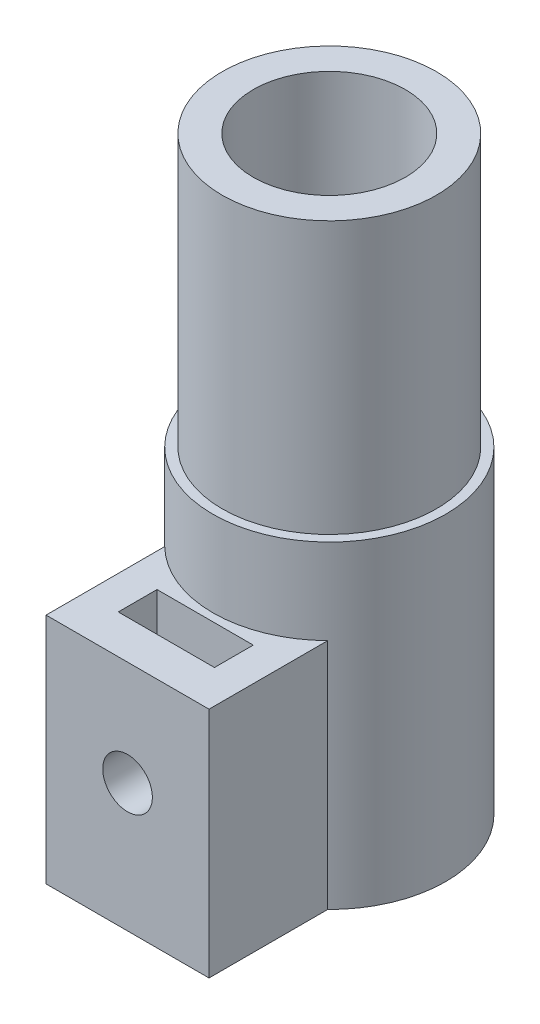
ISO-10303-21;
HEADER;
FILE_DESCRIPTION(('STEP AP214'),'2;1');
FILE_NAME('part.step','',(''),(''),'','','');
FILE_SCHEMA(('AUTOMOTIVE_DESIGN { 1 0 10303 214 1 1 1 1 }'));
ENDSEC;
DATA;
#1=APPLICATION_CONTEXT('core data for automotive mechanical design processes');
#2=APPLICATION_PROTOCOL_DEFINITION('international standard','automotive_design',2000,#1);
#3=PRODUCT_CONTEXT('',#1,'mechanical');
#4=PRODUCT('Part','Part','',(#3));
#5=PRODUCT_RELATED_PRODUCT_CATEGORY('part','',(#4));
#6=PRODUCT_DEFINITION_FORMATION('','',#4);
#7=PRODUCT_DEFINITION_CONTEXT('part definition',#1,'design');
#8=PRODUCT_DEFINITION('design','',#6,#7);
#9=PRODUCT_DEFINITION_SHAPE('','',#8);
#10=(LENGTH_UNIT() NAMED_UNIT(*) SI_UNIT(.MILLI.,.METRE.));
#11=(NAMED_UNIT(*) PLANE_ANGLE_UNIT() SI_UNIT($,.RADIAN.));
#12=(NAMED_UNIT(*) SI_UNIT($,.STERADIAN.) SOLID_ANGLE_UNIT());
#13=UNCERTAINTY_MEASURE_WITH_UNIT(LENGTH_MEASURE(1.E-05),#10,'distance_accuracy_value','');
#14=(GEOMETRIC_REPRESENTATION_CONTEXT(3) GLOBAL_UNCERTAINTY_ASSIGNED_CONTEXT((#13)) GLOBAL_UNIT_ASSIGNED_CONTEXT((#10,
#11,#12)) REPRESENTATION_CONTEXT('',''));
#15=CARTESIAN_POINT('',(0.,0.,0.));
#16=DIRECTION('',(0.,0.,1.));
#17=DIRECTION('',(1.,0.,0.));
#18=AXIS2_PLACEMENT_3D('',#15,#16,#17);
#19=CARTESIAN_POINT('',(0.,-23.,-7.501));
#20=DIRECTION('',(0.,-1.,0.));
#21=DIRECTION('',(0.,0.,-1.));
#22=AXIS2_PLACEMENT_3D('',#19,#20,#21);
#23=PLANE('',#22);
#24=CARTESIAN_POINT('',(0.,-23.,0.));
#25=DIRECTION('',(0.,-1.,0.));
#26=DIRECTION('',(0.,0.,-1.));
#27=AXIS2_PLACEMENT_3D('',#24,#25,#26);
#28=CIRCLE('',#27,7.5);
#29=CARTESIAN_POINT('',(-5.25,-23.,5.35607132140714));
#30=VERTEX_POINT('',#29);
#31=CARTESIAN_POINT('',(5.25,-23.,5.35607132140714));
#32=VERTEX_POINT('',#31);
#33=EDGE_CURVE('E58',#30,#32,#28,.F.);
#34=ORIENTED_EDGE('',*,*,#33,.F.);
#35=DIRECTION('',(0.,0.,1.));
#36=VECTOR('',#35,1.);
#37=CARTESIAN_POINT('',(-5.25,-23.,-7.501));
#38=LINE('',#37,#36);
#39=CARTESIAN_POINT('',(-5.25,-23.,13.));
#40=VERTEX_POINT('',#39);
#41=EDGE_CURVE('E137',#30,#40,#38,.T.);
#42=ORIENTED_EDGE('',*,*,#41,.T.);
#43=DIRECTION('',(1.,0.,0.));
#44=VECTOR('',#43,1.);
#45=CARTESIAN_POINT('',(0.,-23.,13.));
#46=LINE('',#45,#44);
#47=CARTESIAN_POINT('',(5.25,-23.,13.));
#48=VERTEX_POINT('',#47);
#49=EDGE_CURVE('E133',#40,#48,#46,.T.);
#50=ORIENTED_EDGE('',*,*,#49,.T.);
#51=DIRECTION('',(0.,0.,1.));
#52=VECTOR('',#51,1.);
#53=CARTESIAN_POINT('',(5.25,-23.,-7.501));
#54=LINE('',#53,#52);
#55=EDGE_CURVE('E145',#32,#48,#54,.T.);
#56=ORIENTED_EDGE('',*,*,#55,.F.);
#57=EDGE_LOOP('',(#34,#42,#50,#56));
#58=FACE_BOUND('',#57,.T.);
#59=DIRECTION('',(-1.,0.,0.));
#60=VECTOR('',#59,1.);
#61=CARTESIAN_POINT('',(-3.1,-23.,8.));
#62=LINE('',#61,#60);
#63=CARTESIAN_POINT('',(3.1,-23.,8.));
#64=VERTEX_POINT('',#63);
#65=CARTESIAN_POINT('',(-3.1,-23.,8.));
#66=VERTEX_POINT('',#65);
#67=EDGE_CURVE('E111',#64,#66,#62,.T.);
#68=ORIENTED_EDGE('',*,*,#67,.F.);
#69=DIRECTION('',(0.,0.,1.));
#70=VECTOR('',#69,1.);
#71=CARTESIAN_POINT('',(3.1,-23.,8.));
#72=LINE('',#71,#70);
#73=CARTESIAN_POINT('',(3.1,-23.,10.5));
#74=VERTEX_POINT('',#73);
#75=EDGE_CURVE('E150',#64,#74,#72,.T.);
#76=ORIENTED_EDGE('',*,*,#75,.T.);
#77=DIRECTION('',(-1.,0.,0.));
#78=VECTOR('',#77,1.);
#79=CARTESIAN_POINT('',(-3.1,-23.,10.5));
#80=LINE('',#79,#78);
#81=CARTESIAN_POINT('',(-3.1,-23.,10.5));
#82=VERTEX_POINT('',#81);
#83=EDGE_CURVE('E122',#74,#82,#80,.T.);
#84=ORIENTED_EDGE('',*,*,#83,.T.);
#85=DIRECTION('',(0.,0.,1.));
#86=VECTOR('',#85,1.);
#87=CARTESIAN_POINT('',(-3.1,-23.,8.));
#88=LINE('',#87,#86);
#89=EDGE_CURVE('E104',#66,#82,#88,.T.);
#90=ORIENTED_EDGE('',*,*,#89,.F.);
#91=EDGE_LOOP('',(#68,#76,#84,#90));
#92=FACE_BOUND('',#91,.T.);
#93=ADVANCED_FACE('F34',(#58,#92),#23,.F.);
#94=CARTESIAN_POINT('',(0.,-38.,0.));
#95=DIRECTION('',(0.,1.,0.));
#96=DIRECTION('',(0.,0.,1.));
#97=AXIS2_PLACEMENT_3D('',#94,#95,#96);
#98=CYLINDRICAL_SURFACE('',#97,7.5);
#99=CARTESIAN_POINT('',(0.,-17.5,0.));
#100=DIRECTION('',(0.,-1.,0.));
#101=DIRECTION('',(0.,0.,-1.));
#102=AXIS2_PLACEMENT_3D('',#99,#100,#101);
#103=CIRCLE('',#102,7.5);
#104=CARTESIAN_POINT('',(0.,-17.5,-7.5));
#105=VERTEX_POINT('',#104);
#106=EDGE_CURVE('E158',#105,#105,#103,.T.);
#107=ORIENTED_EDGE('',*,*,#106,.T.);
#108=EDGE_LOOP('',(#107));
#109=FACE_BOUND('',#108,.T.);
#110=DIRECTION('',(0.,1.,0.));
#111=VECTOR('',#110,1.);
#112=CARTESIAN_POINT('',(5.25,-38.,5.35607132140713));
#113=LINE('',#112,#111);
#114=CARTESIAN_POINT('',(5.25,-38.,5.35607132140713));
#115=VERTEX_POINT('',#114);
#116=EDGE_CURVE('E132',#32,#115,#113,.F.);
#117=ORIENTED_EDGE('',*,*,#116,.T.);
#118=CARTESIAN_POINT('',(0.,-38.,0.));
#119=DIRECTION('',(0.,-1.,0.));
#120=DIRECTION('',(0.,0.,-1.));
#121=AXIS2_PLACEMENT_3D('',#118,#119,#120);
#122=CIRCLE('',#121,7.5);
#123=CARTESIAN_POINT('',(-5.25,-38.,5.35607132140713));
#124=VERTEX_POINT('',#123);
#125=EDGE_CURVE('E159',#124,#115,#122,.T.);
#126=ORIENTED_EDGE('',*,*,#125,.F.);
#127=DIRECTION('',(0.,1.,0.));
#128=VECTOR('',#127,1.);
#129=CARTESIAN_POINT('',(-5.25,-38.,5.35607132140713));
#130=LINE('',#129,#128);
#131=EDGE_CURVE('E153',#124,#30,#130,.T.);
#132=ORIENTED_EDGE('',*,*,#131,.T.);
#133=ORIENTED_EDGE('',*,*,#33,.T.);
#134=EDGE_LOOP('',(#117,#126,#132,#133));
#135=FACE_BOUND('',#134,.T.);
#136=ADVANCED_FACE('F180',(#109,#135),#98,.T.);
#137=CARTESIAN_POINT('',(0.,-38.,0.));
#138=DIRECTION('',(0.,1.,0.));
#139=DIRECTION('',(0.,0.,1.));
#140=AXIS2_PLACEMENT_3D('',#137,#138,#139);
#141=CYLINDRICAL_SURFACE('',#140,6.9);
#142=CARTESIAN_POINT('',(0.,0.,0.));
#143=DIRECTION('',(0.,1.,0.));
#144=DIRECTION('',(0.,0.,1.));
#145=AXIS2_PLACEMENT_3D('',#142,#143,#144);
#146=CIRCLE('',#145,6.9);
#147=CARTESIAN_POINT('',(0.,0.,6.9));
#148=VERTEX_POINT('',#147);
#149=EDGE_CURVE('E11',#148,#148,#146,.T.);
#150=ORIENTED_EDGE('',*,*,#149,.F.);
#151=EDGE_LOOP('',(#150));
#152=FACE_BOUND('',#151,.T.);
#153=CARTESIAN_POINT('',(0.,-17.5,0.));
#154=DIRECTION('',(0.,-1.,0.));
#155=DIRECTION('',(0.,0.,-1.));
#156=AXIS2_PLACEMENT_3D('',#153,#154,#155);
#157=CIRCLE('',#156,6.9);
#158=CARTESIAN_POINT('',(0.,-17.5,-6.9));
#159=VERTEX_POINT('',#158);
#160=EDGE_CURVE('E152',#159,#159,#157,.T.);
#161=ORIENTED_EDGE('',*,*,#160,.F.);
#162=EDGE_LOOP('',(#161));
#163=FACE_BOUND('',#162,.T.);
#164=ADVANCED_FACE('F36',(#152,#163),#141,.T.);
#165=CARTESIAN_POINT('',(0.,-38.,0.));
#166=DIRECTION('',(0.,1.,0.));
#167=DIRECTION('',(0.,0.,1.));
#168=AXIS2_PLACEMENT_3D('',#165,#166,#167);
#169=PLANE('',#168);
#170=CARTESIAN_POINT('',(0.,-38.,0.));
#171=DIRECTION('',(0.,1.,0.));
#172=DIRECTION('',(0.,0.,1.));
#173=AXIS2_PLACEMENT_3D('',#170,#171,#172);
#174=CIRCLE('',#173,4.9);
#175=CARTESIAN_POINT('',(0.,-38.,4.9));
#176=VERTEX_POINT('',#175);
#177=EDGE_CURVE('E43',#176,#176,#174,.T.);
#178=ORIENTED_EDGE('',*,*,#177,.T.);
#179=EDGE_LOOP('',(#178));
#180=FACE_BOUND('',#179,.T.);
#181=ORIENTED_EDGE('',*,*,#125,.T.);
#182=DIRECTION('',(0.,0.,1.));
#183=VECTOR('',#182,1.);
#184=CARTESIAN_POINT('',(5.25,-38.,-7.501));
#185=LINE('',#184,#183);
#186=CARTESIAN_POINT('',(5.25,-38.,13.));
#187=VERTEX_POINT('',#186);
#188=EDGE_CURVE('E144',#115,#187,#185,.T.);
#189=ORIENTED_EDGE('',*,*,#188,.T.);
#190=DIRECTION('',(1.,0.,0.));
#191=VECTOR('',#190,1.);
#192=CARTESIAN_POINT('',(0.,-38.,13.));
#193=LINE('',#192,#191);
#194=CARTESIAN_POINT('',(-5.25,-38.,13.));
#195=VERTEX_POINT('',#194);
#196=EDGE_CURVE('E129',#195,#187,#193,.T.);
#197=ORIENTED_EDGE('',*,*,#196,.F.);
#198=DIRECTION('',(0.,0.,1.));
#199=VECTOR('',#198,1.);
#200=CARTESIAN_POINT('',(-5.25,-38.,-7.501));
#201=LINE('',#200,#199);
#202=EDGE_CURVE('E138',#124,#195,#201,.T.);
#203=ORIENTED_EDGE('',*,*,#202,.F.);
#204=EDGE_LOOP('',(#181,#189,#197,#203));
#205=FACE_BOUND('',#204,.T.);
#206=ADVANCED_FACE('F175',(#180,#205),#169,.F.);
#207=CARTESIAN_POINT('',(0.,0.,0.));
#208=DIRECTION('',(0.,1.,0.));
#209=DIRECTION('',(0.,0.,1.));
#210=AXIS2_PLACEMENT_3D('',#207,#208,#209);
#211=PLANE('',#210);
#212=CARTESIAN_POINT('',(0.,0.,0.));
#213=DIRECTION('',(0.,1.,0.));
#214=DIRECTION('',(0.,0.,1.));
#215=AXIS2_PLACEMENT_3D('',#212,#213,#214);
#216=CIRCLE('',#215,4.9);
#217=CARTESIAN_POINT('',(0.,0.,4.9));
#218=VERTEX_POINT('',#217);
#219=EDGE_CURVE('E162',#218,#218,#216,.T.);
#220=ORIENTED_EDGE('',*,*,#219,.F.);
#221=EDGE_LOOP('',(#220));
#222=FACE_BOUND('',#221,.T.);
#223=ORIENTED_EDGE('',*,*,#149,.T.);
#224=EDGE_LOOP('',(#223));
#225=FACE_BOUND('',#224,.T.);
#226=ADVANCED_FACE('F172',(#222,#225),#211,.T.);
#227=CARTESIAN_POINT('',(0.,-38.,0.));
#228=DIRECTION('',(0.,1.,0.));
#229=DIRECTION('',(0.,0.,1.));
#230=AXIS2_PLACEMENT_3D('',#227,#228,#229);
#231=CYLINDRICAL_SURFACE('',#230,4.9);
#232=CARTESIAN_POINT('',(0.,-31.35,4.9));
#233=CARTESIAN_POINT('',(0.0874014293536911,-31.3500000634485,4.89999999971381));
#234=CARTESIAN_POINT('',(0.174803233362862,-31.3428150256669,4.89763979328649));
#235=CARTESIAN_POINT('',(0.347038515883745,-31.314348446423,4.88845652705669));
#236=CARTESIAN_POINT('',(0.431871622426159,-31.2930648734846,4.88163282410501));
#237=CARTESIAN_POINT('',(0.596461404626,-31.2372042890155,4.86426534801006));
#238=CARTESIAN_POINT('',(0.676226113169524,-31.2026489569529,4.85372764400085));
#239=CARTESIAN_POINT('',(0.828828360317951,-31.1213218349192,4.8300118731224));
#240=CARTESIAN_POINT('',(0.901664617351335,-31.0745477907959,4.81683331916421));
#241=CARTESIAN_POINT('',(1.04077486390696,-30.9684692336025,4.78873452336802));
#242=CARTESIAN_POINT('',(1.10678534346981,-30.9088299353131,4.77377379703106));
#243=CARTESIAN_POINT('',(1.22806717063048,-30.7794259314326,4.7440234135004));
#244=CARTESIAN_POINT('',(1.28333627919191,-30.7096591200471,4.72923379257652));
#245=CARTESIAN_POINT('',(1.38304540039897,-30.5596386160959,4.70105841481271));
#246=CARTESIAN_POINT('',(1.42714733036979,-30.4791500228624,4.68772220678977));
#247=CARTESIAN_POINT('',(1.50107738679759,-30.3113925023463,4.6645769764037));
#248=CARTESIAN_POINT('',(1.53090966880688,-30.2241255576448,4.65476692737312));
#249=CARTESIAN_POINT('',(1.57447313368648,-30.0482776244194,4.64021009641221));
#250=CARTESIAN_POINT('',(1.58869646786133,-29.9598317035558,4.63530900268779));
#251=CARTESIAN_POINT('',(1.60217651927081,-29.7816834780391,4.63066798720174));
#252=CARTESIAN_POINT('',(1.60143764191842,-29.6919815509726,4.63092654625252));
#253=CARTESIAN_POINT('',(1.58539729697608,-29.5180222505831,4.63644006546434));
#254=CARTESIAN_POINT('',(1.57073245938379,-29.4336980627196,4.64147658929343));
#255=CARTESIAN_POINT('',(1.52829291720958,-29.2687797019929,4.65562197595824));
#256=CARTESIAN_POINT('',(1.50051670216347,-29.1881859600616,4.6647313079855));
#257=CARTESIAN_POINT('',(1.4322153105112,-29.0315465825097,4.68615544254523));
#258=CARTESIAN_POINT('',(1.39149777641423,-28.955591649353,4.69851809092869));
#259=CARTESIAN_POINT('',(1.2986031102665,-28.811388667587,4.72503523132102));
#260=CARTESIAN_POINT('',(1.24642277678622,-28.7431427801056,4.73919022344237));
#261=CARTESIAN_POINT('',(1.12900402852876,-28.6127103996829,4.76856216268143));
#262=CARTESIAN_POINT('',(1.0632434245253,-28.5509970575082,4.78379683195515));
#263=CARTESIAN_POINT('',(0.92211803827881,-28.4393535920719,4.81299116513241));
#264=CARTESIAN_POINT('',(0.846752408797552,-28.3894245093832,4.82695071637389));
#265=CARTESIAN_POINT('',(0.687583423557859,-28.3024063050461,4.85219252716738));
#266=CARTESIAN_POINT('',(0.603708937960705,-28.2654393062601,4.8634490233135));
#267=CARTESIAN_POINT('',(0.430477137527891,-28.2062840938062,4.88182979118734));
#268=CARTESIAN_POINT('',(0.341121657913843,-28.1840909625327,4.88895543780086));
#269=CARTESIAN_POINT('',(0.163473448312352,-28.1559409398929,4.89804604337665));
#270=CARTESIAN_POINT('',(0.0752923488009253,-28.1493443121823,4.90021421752082));
#271=CARTESIAN_POINT('',(-0.100931433526089,-28.1507584022448,4.89975224357504));
#272=CARTESIAN_POINT('',(-0.188974136356536,-28.158766766347,4.89712286863527));
#273=CARTESIAN_POINT('',(-0.35989241552416,-28.1886547385919,4.88749519921403));
#274=CARTESIAN_POINT('',(-0.442843531142292,-28.2101456780251,4.88061940216587));
#275=CARTESIAN_POINT('',(-0.603932882327139,-28.265906713148,4.8633150774251));
#276=CARTESIAN_POINT('',(-0.682070508018005,-28.3001784243148,4.85288610062844));
#277=CARTESIAN_POINT('',(-0.833551516064568,-28.3815074172574,4.82920530148766));
#278=CARTESIAN_POINT('',(-0.906720087751347,-28.4288706389308,4.81588782297455));
#279=CARTESIAN_POINT('',(-1.04428114045379,-28.5346762844123,4.78794444403236));
#280=CARTESIAN_POINT('',(-1.10867102904198,-28.5931219688458,4.77331815920346));
#281=CARTESIAN_POINT('',(-1.22975944655895,-28.7224428764163,4.74360100554663));
#282=CARTESIAN_POINT('',(-1.28600156289677,-28.7937481888055,4.72851760370037));
#283=CARTESIAN_POINT('',(-1.3857731148604,-28.9451101157883,4.70024796088225));
#284=CARTESIAN_POINT('',(-1.42930255835145,-29.0251667249673,4.68706171873664));
#285=CARTESIAN_POINT('',(-1.50218550609757,-29.1917207279436,4.66421507586187));
#286=CARTESIAN_POINT('',(-1.53157737506326,-29.278199947263,4.65454515063247));
#287=CARTESIAN_POINT('',(-1.57525800715992,-29.4552663520472,4.63994643840736));
#288=CARTESIAN_POINT('',(-1.5895532142373,-29.5458517675653,4.63501562862109));
#289=CARTESIAN_POINT('',(-1.60214501747017,-29.7237519808907,4.63067715583566));
#290=CARTESIAN_POINT('',(-1.60119616383378,-29.8110076345785,4.63100899158848));
#291=CARTESIAN_POINT('',(-1.58517199622342,-29.9840482053494,4.63651807601459));
#292=CARTESIAN_POINT('',(-1.57009745968153,-30.0698332031082,4.64169505802663));
#293=CARTESIAN_POINT('',(-1.52677459791431,-30.2360114477644,4.65612102535834));
#294=CARTESIAN_POINT('',(-1.4987611220654,-30.3164727248043,4.66529726093467));
#295=CARTESIAN_POINT('',(-1.43054391073714,-30.4716157917383,4.68666360440822));
#296=CARTESIAN_POINT('',(-1.3903375406279,-30.5462963281529,4.69885436357586));
#297=CARTESIAN_POINT('',(-1.29689625606734,-30.691169407818,4.72551712630831));
#298=CARTESIAN_POINT('',(-1.24318350168285,-30.7610399706374,4.74006364133523));
#299=CARTESIAN_POINT('',(-1.12507288089449,-30.8910199049498,4.76947692083084));
#300=CARTESIAN_POINT('',(-1.06067204911328,-30.9511265582895,4.78434377317735));
#301=CARTESIAN_POINT('',(-0.920163874354618,-31.0620983217839,4.81337966233304));
#302=CARTESIAN_POINT('',(-0.843712794410246,-31.112541646978,4.82750284724961));
#303=CARTESIAN_POINT('',(-0.682958646237212,-31.1998015603717,4.85285222489898));
#304=CARTESIAN_POINT('',(-0.598657962518849,-31.2366222699822,4.86407929351634));
#305=CARTESIAN_POINT('',(-0.429636164049237,-31.2936647610352,4.88182430600953));
#306=CARTESIAN_POINT('',(-0.345222812718227,-31.3147251626752,4.88857754140797));
#307=CARTESIAN_POINT('',(-0.173872673868714,-31.3428910074626,4.89766483654083));
#308=CARTESIAN_POINT('',(-0.0869365222745233,-31.349999936889,4.90000000028467));
#309=CARTESIAN_POINT('',(0.,-31.35,4.9));
#310=B_SPLINE_CURVE_WITH_KNOTS('',3,(#232,#233,#234,#235,#236,#237,#238,#239,#240,#241,#242,
#243,#244,#245,#246,#247,#248,#249,#250,#251,#252,#253,#254,#255,#256,#257,#258,#259,#260,#261,
#262,#263,#264,#265,#266,#267,#268,#269,#270,#271,#272,#273,#274,#275,#276,#277,#278,#279,#280,
#281,#282,#283,#284,#285,#286,#287,#288,#289,#290,#291,#292,#293,#294,#295,#296,#297,#298,#299,
#300,#301,#302,#303,#304,#305,#306,#307,#308,#309),.UNSPECIFIED.,.T.,.F.,(4,2,2,2,2,2,2,2,2,2,2,
2,2,2,2,2,2,2,2,2,2,2,2,2,2,2,2,2,2,2,2,2,2,2,2,2,2,2,4),(0.,0.26188449026644,0.523806724016616,
0.785302914112555,1.04684738008126,1.31626422290182,1.58573716550902,1.86259117005623,
2.13936450107909,2.40713535148289,2.67482736166841,2.93084257414792,3.18688728743508,
3.44693132592557,3.7070480843043,3.98016192342297,4.25329987000956,4.52894610403096,
4.80450054095286,5.06853990180545,5.33253671509006,5.5892523452883,5.84600043509684,
6.10934664467762,6.37277045519023,6.64765313565237,6.92253564604651,7.19666794772978,
7.4706831898442,7.73117890485949,7.99166028387154,8.24758910392695,8.50357326430833,
8.77035029969248,9.03720147574115,9.31387858076835,9.5904719108192,9.85102849868416,
10.1115199687866),.UNSPECIFIED.);
#311=CARTESIAN_POINT('',(0.,-31.35,4.9));
#312=VERTEX_POINT('',#311);
#313=EDGE_CURVE('E237',#312,#312,#310,.T.);
#314=ORIENTED_EDGE('',*,*,#313,.T.);
#315=EDGE_LOOP('',(#314));
#316=FACE_BOUND('',#315,.T.);
#317=ORIENTED_EDGE('',*,*,#177,.F.);
#318=EDGE_LOOP('',(#317));
#319=FACE_BOUND('',#318,.T.);
#320=ORIENTED_EDGE('',*,*,#219,.T.);
#321=EDGE_LOOP('',(#320));
#322=FACE_BOUND('',#321,.T.);
#323=ADVANCED_FACE('F170',(#316,#319,#322),#231,.F.);
#324=CARTESIAN_POINT('',(0.,-17.5,0.));
#325=DIRECTION('',(0.,-1.,0.));
#326=DIRECTION('',(0.,0.,-1.));
#327=AXIS2_PLACEMENT_3D('',#324,#325,#326);
#328=PLANE('',#327);
#329=ORIENTED_EDGE('',*,*,#106,.F.);
#330=EDGE_LOOP('',(#329));
#331=FACE_BOUND('',#330,.T.);
#332=ORIENTED_EDGE('',*,*,#160,.T.);
#333=EDGE_LOOP('',(#332));
#334=FACE_BOUND('',#333,.T.);
#335=ADVANCED_FACE('F183',(#331,#334),#328,.F.);
#336=CARTESIAN_POINT('',(5.25,0.,-7.501));
#337=DIRECTION('',(-1.,0.,0.));
#338=DIRECTION('',(0.,-1.,0.));
#339=AXIS2_PLACEMENT_3D('',#336,#337,#338);
#340=PLANE('',#339);
#341=ORIENTED_EDGE('',*,*,#116,.F.);
#342=ORIENTED_EDGE('',*,*,#55,.T.);
#343=DIRECTION('',(0.,-1.,0.));
#344=VECTOR('',#343,1.);
#345=CARTESIAN_POINT('',(5.25,0.,13.));
#346=LINE('',#345,#344);
#347=EDGE_CURVE('E141',#48,#187,#346,.T.);
#348=ORIENTED_EDGE('',*,*,#347,.T.);
#349=ORIENTED_EDGE('',*,*,#188,.F.);
#350=EDGE_LOOP('',(#341,#342,#348,#349));
#351=FACE_BOUND('',#350,.T.);
#352=ADVANCED_FACE('F185',(#351),#340,.F.);
#353=CARTESIAN_POINT('',(-5.25,0.,-7.501));
#354=DIRECTION('',(1.,0.,0.));
#355=DIRECTION('',(0.,1.,0.));
#356=AXIS2_PLACEMENT_3D('',#353,#354,#355);
#357=PLANE('',#356);
#358=ORIENTED_EDGE('',*,*,#131,.F.);
#359=ORIENTED_EDGE('',*,*,#202,.T.);
#360=DIRECTION('',(0.,1.,0.));
#361=VECTOR('',#360,1.);
#362=CARTESIAN_POINT('',(-5.25,0.,13.));
#363=LINE('',#362,#361);
#364=EDGE_CURVE('E134',#195,#40,#363,.T.);
#365=ORIENTED_EDGE('',*,*,#364,.T.);
#366=ORIENTED_EDGE('',*,*,#41,.F.);
#367=EDGE_LOOP('',(#358,#359,#365,#366));
#368=FACE_BOUND('',#367,.T.);
#369=ADVANCED_FACE('F192',(#368),#357,.F.);
#370=CARTESIAN_POINT('',(0.,0.,13.));
#371=DIRECTION('',(0.,0.,1.));
#372=DIRECTION('',(1.,0.,0.));
#373=AXIS2_PLACEMENT_3D('',#370,#371,#372);
#374=PLANE('',#373);
#375=CARTESIAN_POINT('',(0.,-29.75,13.));
#376=DIRECTION('',(0.,0.,1.));
#377=DIRECTION('',(1.,0.,0.));
#378=AXIS2_PLACEMENT_3D('',#375,#376,#377);
#379=CIRCLE('',#378,1.6);
#380=CARTESIAN_POINT('',(1.6,-29.75,13.));
#381=VERTEX_POINT('',#380);
#382=EDGE_CURVE('E321',#381,#381,#379,.T.);
#383=ORIENTED_EDGE('',*,*,#382,.F.);
#384=EDGE_LOOP('',(#383));
#385=FACE_BOUND('',#384,.T.);
#386=ORIENTED_EDGE('',*,*,#347,.F.);
#387=ORIENTED_EDGE('',*,*,#49,.F.);
#388=ORIENTED_EDGE('',*,*,#364,.F.);
#389=ORIENTED_EDGE('',*,*,#196,.T.);
#390=EDGE_LOOP('',(#386,#387,#388,#389));
#391=FACE_BOUND('',#390,.T.);
#392=ADVANCED_FACE('F208',(#385,#391),#374,.T.);
#393=CARTESIAN_POINT('',(3.1,-23.,8.));
#394=DIRECTION('',(1.,0.,0.));
#395=DIRECTION('',(0.,1.,0.));
#396=AXIS2_PLACEMENT_3D('',#393,#394,#395);
#397=PLANE('',#396);
#398=DIRECTION('',(0.,1.,0.));
#399=VECTOR('',#398,1.);
#400=CARTESIAN_POINT('',(3.1,-23.,10.5));
#401=LINE('',#400,#399);
#402=CARTESIAN_POINT('',(3.1,-29.75,10.5));
#403=VERTEX_POINT('',#402);
#404=EDGE_CURVE('E120',#403,#74,#401,.T.);
#405=ORIENTED_EDGE('',*,*,#404,.T.);
#406=ORIENTED_EDGE('',*,*,#75,.F.);
#407=DIRECTION('',(0.,1.,0.));
#408=VECTOR('',#407,1.);
#409=CARTESIAN_POINT('',(3.1,-23.,8.));
#410=LINE('',#409,#408);
#411=CARTESIAN_POINT('',(3.1,-29.75,8.));
#412=VERTEX_POINT('',#411);
#413=EDGE_CURVE('E117',#412,#64,#410,.T.);
#414=ORIENTED_EDGE('',*,*,#413,.F.);
#415=DIRECTION('',(0.,0.,1.));
#416=VECTOR('',#415,1.);
#417=CARTESIAN_POINT('',(3.1,-29.75,8.));
#418=LINE('',#417,#416);
#419=EDGE_CURVE('E124',#412,#403,#418,.T.);
#420=ORIENTED_EDGE('',*,*,#419,.T.);
#421=EDGE_LOOP('',(#405,#406,#414,#420));
#422=FACE_BOUND('',#421,.T.);
#423=ADVANCED_FACE('F213',(#422),#397,.F.);
#424=CARTESIAN_POINT('',(0.,-29.75,8.));
#425=DIRECTION('',(0.,0.,1.));
#426=DIRECTION('',(1.,0.,0.));
#427=AXIS2_PLACEMENT_3D('',#424,#425,#426);
#428=CYLINDRICAL_SURFACE('',#427,3.1);
#429=CARTESIAN_POINT('',(0.,-29.75,10.5));
#430=DIRECTION('',(0.,0.,1.));
#431=DIRECTION('',(1.,0.,0.));
#432=AXIS2_PLACEMENT_3D('',#429,#430,#431);
#433=CIRCLE('',#432,3.1);
#434=CARTESIAN_POINT('',(-3.1,-29.75,10.5));
#435=VERTEX_POINT('',#434);
#436=EDGE_CURVE('E332',#435,#403,#433,.T.);
#437=ORIENTED_EDGE('',*,*,#436,.T.);
#438=ORIENTED_EDGE('',*,*,#419,.F.);
#439=CARTESIAN_POINT('',(0.,-29.75,8.));
#440=DIRECTION('',(0.,0.,1.));
#441=DIRECTION('',(1.,0.,0.));
#442=AXIS2_PLACEMENT_3D('',#439,#440,#441);
#443=CIRCLE('',#442,3.1);
#444=CARTESIAN_POINT('',(-3.1,-29.75,8.));
#445=VERTEX_POINT('',#444);
#446=EDGE_CURVE('E110',#445,#412,#443,.T.);
#447=ORIENTED_EDGE('',*,*,#446,.F.);
#448=DIRECTION('',(0.,0.,1.));
#449=VECTOR('',#448,1.);
#450=CARTESIAN_POINT('',(-3.1,-29.75,8.));
#451=LINE('',#450,#449);
#452=EDGE_CURVE('E106',#445,#435,#451,.T.);
#453=ORIENTED_EDGE('',*,*,#452,.T.);
#454=EDGE_LOOP('',(#437,#438,#447,#453));
#455=FACE_BOUND('',#454,.T.);
#456=ADVANCED_FACE('F217',(#455),#428,.F.);
#457=CARTESIAN_POINT('',(-3.1,-23.,8.));
#458=DIRECTION('',(-1.,0.,0.));
#459=DIRECTION('',(0.,-1.,0.));
#460=AXIS2_PLACEMENT_3D('',#457,#458,#459);
#461=PLANE('',#460);
#462=DIRECTION('',(0.,-1.,0.));
#463=VECTOR('',#462,1.);
#464=CARTESIAN_POINT('',(-3.1,-23.,10.5));
#465=LINE('',#464,#463);
#466=EDGE_CURVE('E50',#82,#435,#465,.T.);
#467=ORIENTED_EDGE('',*,*,#466,.T.);
#468=ORIENTED_EDGE('',*,*,#452,.F.);
#469=DIRECTION('',(0.,-1.,0.));
#470=VECTOR('',#469,1.);
#471=CARTESIAN_POINT('',(-3.1,-23.,8.));
#472=LINE('',#471,#470);
#473=EDGE_CURVE('E100',#66,#445,#472,.T.);
#474=ORIENTED_EDGE('',*,*,#473,.F.);
#475=ORIENTED_EDGE('',*,*,#89,.T.);
#476=EDGE_LOOP('',(#467,#468,#474,#475));
#477=FACE_BOUND('',#476,.T.);
#478=ADVANCED_FACE('F102',(#477),#461,.F.);
#479=CARTESIAN_POINT('',(0.,-29.75,8.));
#480=DIRECTION('',(0.,0.,1.));
#481=DIRECTION('',(1.,0.,0.));
#482=AXIS2_PLACEMENT_3D('',#479,#480,#481);
#483=PLANE('',#482);
#484=CARTESIAN_POINT('',(0.,-29.75,8.));
#485=DIRECTION('',(0.,0.,1.));
#486=DIRECTION('',(1.,0.,0.));
#487=AXIS2_PLACEMENT_3D('',#484,#485,#486);
#488=CIRCLE('',#487,1.6);
#489=CARTESIAN_POINT('',(1.6,-29.75,8.));
#490=VERTEX_POINT('',#489);
#491=EDGE_CURVE('E242',#490,#490,#488,.T.);
#492=ORIENTED_EDGE('',*,*,#491,.F.);
#493=EDGE_LOOP('',(#492));
#494=FACE_BOUND('',#493,.T.);
#495=ORIENTED_EDGE('',*,*,#67,.T.);
#496=ORIENTED_EDGE('',*,*,#473,.T.);
#497=ORIENTED_EDGE('',*,*,#446,.T.);
#498=ORIENTED_EDGE('',*,*,#413,.T.);
#499=EDGE_LOOP('',(#495,#496,#497,#498));
#500=FACE_BOUND('',#499,.T.);
#501=ADVANCED_FACE('F115',(#494,#500),#483,.T.);
#502=CARTESIAN_POINT('',(0.,-29.75,10.5));
#503=DIRECTION('',(0.,0.,1.));
#504=DIRECTION('',(1.,0.,0.));
#505=AXIS2_PLACEMENT_3D('',#502,#503,#504);
#506=PLANE('',#505);
#507=CARTESIAN_POINT('',(0.,-29.75,10.5));
#508=DIRECTION('',(0.,0.,1.));
#509=DIRECTION('',(1.,0.,0.));
#510=AXIS2_PLACEMENT_3D('',#507,#508,#509);
#511=CIRCLE('',#510,1.6);
#512=CARTESIAN_POINT('',(1.6,-29.75,10.5));
#513=VERTEX_POINT('',#512);
#514=EDGE_CURVE('E38',#513,#513,#511,.T.);
#515=ORIENTED_EDGE('',*,*,#514,.T.);
#516=EDGE_LOOP('',(#515));
#517=FACE_BOUND('',#516,.T.);
#518=ORIENTED_EDGE('',*,*,#83,.F.);
#519=ORIENTED_EDGE('',*,*,#404,.F.);
#520=ORIENTED_EDGE('',*,*,#436,.F.);
#521=ORIENTED_EDGE('',*,*,#466,.F.);
#522=EDGE_LOOP('',(#518,#519,#520,#521));
#523=FACE_BOUND('',#522,.T.);
#524=ADVANCED_FACE('F224',(#517,#523),#506,.F.);
#525=CARTESIAN_POINT('',(0.,-29.75,3.));
#526=DIRECTION('',(0.,0.,1.));
#527=DIRECTION('',(1.,0.,0.));
#528=AXIS2_PLACEMENT_3D('',#525,#526,#527);
#529=CYLINDRICAL_SURFACE('',#528,1.6);
#530=ORIENTED_EDGE('',*,*,#382,.T.);
#531=EDGE_LOOP('',(#530));
#532=FACE_BOUND('',#531,.T.);
#533=ORIENTED_EDGE('',*,*,#514,.F.);
#534=EDGE_LOOP('',(#533));
#535=FACE_BOUND('',#534,.T.);
#536=ADVANCED_FACE('F227',(#532,#535),#529,.F.);
#537=ORIENTED_EDGE('',*,*,#491,.T.);
#538=EDGE_LOOP('',(#537));
#539=FACE_BOUND('',#538,.T.);
#540=ORIENTED_EDGE('',*,*,#313,.F.);
#541=EDGE_LOOP('',(#540));
#542=FACE_BOUND('',#541,.T.);
#543=ADVANCED_FACE('F232',(#539,#542),#529,.F.);
#544=CLOSED_SHELL('',(#93,#136,#164,#206,#226,#323,#335,#352,#369,#392,#423,#456,#478,#501,#524,
#536,#543));
#545=MANIFOLD_SOLID_BREP('B2',#544);
#546=ADVANCED_BREP_SHAPE_REPRESENTATION('',(#18,#545),#14);
#547=SHAPE_DEFINITION_REPRESENTATION(#9,#546);
ENDSEC;
END-ISO-10303-21;
